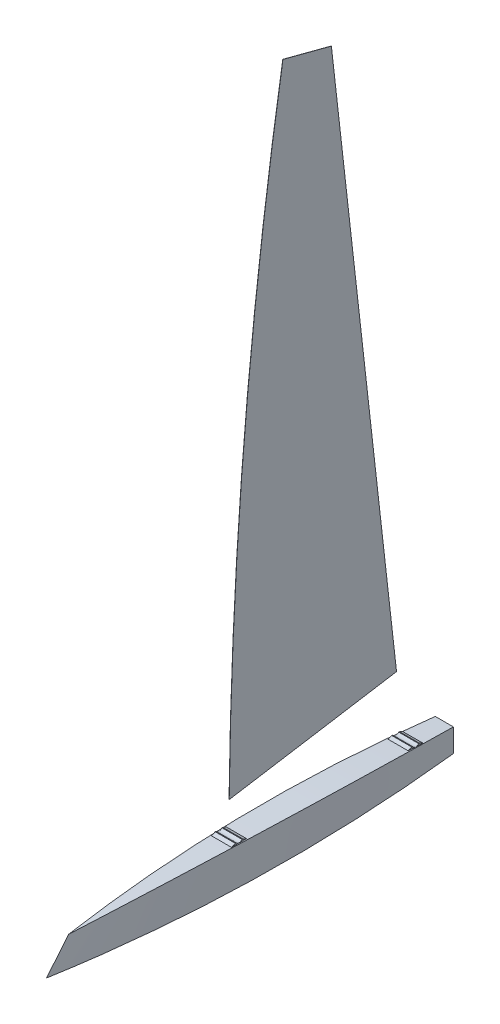
ISO-10303-21;
HEADER;
FILE_DESCRIPTION(('STEP AP214'),'2;1');
FILE_NAME('part.step','',(''),(''),'','','');
FILE_SCHEMA(('AUTOMOTIVE_DESIGN { 1 0 10303 214 1 1 1 1 }'));
ENDSEC;
DATA;
#1=APPLICATION_CONTEXT('core data for automotive mechanical design processes');
#2=APPLICATION_PROTOCOL_DEFINITION('international standard','automotive_design',2000,#1);
#3=PRODUCT_CONTEXT('',#1,'mechanical');
#4=PRODUCT('Part','Part','',(#3));
#5=PRODUCT_RELATED_PRODUCT_CATEGORY('part','',(#4));
#6=PRODUCT_DEFINITION_FORMATION('','',#4);
#7=PRODUCT_DEFINITION_CONTEXT('part definition',#1,'design');
#8=PRODUCT_DEFINITION('design','',#6,#7);
#9=PRODUCT_DEFINITION_SHAPE('','',#8);
#10=(LENGTH_UNIT() NAMED_UNIT(*) SI_UNIT(.MILLI.,.METRE.));
#11=(NAMED_UNIT(*) PLANE_ANGLE_UNIT() SI_UNIT($,.RADIAN.));
#12=(NAMED_UNIT(*) SI_UNIT($,.STERADIAN.) SOLID_ANGLE_UNIT());
#13=UNCERTAINTY_MEASURE_WITH_UNIT(LENGTH_MEASURE(1.E-05),#10,'distance_accuracy_value','');
#14=(GEOMETRIC_REPRESENTATION_CONTEXT(3) GLOBAL_UNCERTAINTY_ASSIGNED_CONTEXT((#13)) GLOBAL_UNIT_ASSIGNED_CONTEXT((#10,
#11,#12)) REPRESENTATION_CONTEXT('',''));
#15=CARTESIAN_POINT('',(0.,0.,0.));
#16=DIRECTION('',(0.,0.,1.));
#17=DIRECTION('',(1.,0.,0.));
#18=AXIS2_PLACEMENT_3D('',#15,#16,#17);
#19=CARTESIAN_POINT('',(2.,165.009193198204,-55771.5122342696));
#20=DIRECTION('',(-1.,0.,0.));
#21=DIRECTION('',(0.,0.,1.));
#22=AXIS2_PLACEMENT_3D('',#19,#20,#21);
#23=CYLINDRICAL_SURFACE('',#22,53408.3333333334);
#24=CARTESIAN_POINT('',(0.,165.009193198204,-55771.5122342696));
#25=DIRECTION('',(1.,0.,0.));
#26=DIRECTION('',(0.,0.,-1.));
#27=AXIS2_PLACEMENT_3D('',#24,#25,#26);
#28=CIRCLE('',#27,53408.3333333334);
#29=CARTESIAN_POINT('',(0.,8791.55758473397,-3064.46590939063));
#30=VERTEX_POINT('',#29);
#31=CARTESIAN_POINT('',(0.,822.,-2367.2199674094));
#32=VERTEX_POINT('',#31);
#33=EDGE_CURVE('E113',#30,#32,#28,.T.);
#34=ORIENTED_EDGE('',*,*,#33,.T.);
#35=DIRECTION('',(-1.,0.,0.));
#36=VECTOR('',#35,1.);
#37=CARTESIAN_POINT('',(2.,822.,-2367.2199674094));
#38=LINE('',#37,#36);
#39=CARTESIAN_POINT('',(2.,822.,-2367.2199674094));
#40=VERTEX_POINT('',#39);
#41=EDGE_CURVE('E12',#40,#32,#38,.T.);
#42=ORIENTED_EDGE('',*,*,#41,.F.);
#43=CARTESIAN_POINT('',(2.,165.009193198204,-55771.5122342696));
#44=DIRECTION('',(1.,0.,0.));
#45=DIRECTION('',(0.,0.,-1.));
#46=AXIS2_PLACEMENT_3D('',#43,#44,#45);
#47=CIRCLE('',#46,53408.3333333334);
#48=CARTESIAN_POINT('',(2.,8791.55758473397,-3064.46590939063));
#49=VERTEX_POINT('',#48);
#50=EDGE_CURVE('E101',#49,#40,#47,.T.);
#51=ORIENTED_EDGE('',*,*,#50,.F.);
#52=DIRECTION('',(-1.,0.,0.));
#53=VECTOR('',#52,1.);
#54=CARTESIAN_POINT('',(2.,8791.55758473397,-3064.46590939063));
#55=LINE('',#54,#53);
#56=EDGE_CURVE('E109',#49,#30,#55,.T.);
#57=ORIENTED_EDGE('',*,*,#56,.T.);
#58=EDGE_LOOP('',(#34,#42,#51,#57));
#59=FACE_BOUND('',#58,.T.);
#60=ADVANCED_FACE('F50',(#59),#23,.T.);
#61=CARTESIAN_POINT('',(2.,822.,-2367.2199674094));
#62=DIRECTION('',(0.,0.987064811696165,0.160321731250675));
#63=DIRECTION('',(0.,-0.160321731250675,0.987064811696166));
#64=AXIS2_PLACEMENT_3D('',#61,#62,#63);
#65=PLANE('',#64);
#66=DIRECTION('',(0.,0.160321731250675,-0.987064811696166));
#67=VECTOR('',#66,1.);
#68=CARTESIAN_POINT('',(0.,822.,-2367.2199674094));
#69=LINE('',#68,#67);
#70=CARTESIAN_POINT('',(0.,1174.70780875148,-4538.76255314097));
#71=VERTEX_POINT('',#70);
#72=EDGE_CURVE('E105',#32,#71,#69,.T.);
#73=ORIENTED_EDGE('',*,*,#72,.T.);
#74=DIRECTION('',(-1.,0.,0.));
#75=VECTOR('',#74,1.);
#76=CARTESIAN_POINT('',(2.,1174.70780875148,-4538.76255314097));
#77=LINE('',#76,#75);
#78=CARTESIAN_POINT('',(2.,1174.70780875148,-4538.76255314097));
#79=VERTEX_POINT('',#78);
#80=EDGE_CURVE('E58',#79,#71,#77,.T.);
#81=ORIENTED_EDGE('',*,*,#80,.F.);
#82=DIRECTION('',(0.,0.160321731250675,-0.987064811696166));
#83=VECTOR('',#82,1.);
#84=CARTESIAN_POINT('',(2.,822.,-2367.2199674094));
#85=LINE('',#84,#83);
#86=EDGE_CURVE('E96',#40,#79,#85,.T.);
#87=ORIENTED_EDGE('',*,*,#86,.F.);
#88=ORIENTED_EDGE('',*,*,#41,.T.);
#89=EDGE_LOOP('',(#73,#81,#87,#88));
#90=FACE_BOUND('',#89,.T.);
#91=ADVANCED_FACE('F104',(#90),#65,.F.);
#92=CARTESIAN_POINT('',(2.,1174.70780875148,-4538.76255314097));
#93=DIRECTION('',(0.,-0.112733136060343,0.993625301627329));
#94=DIRECTION('',(0.,-0.993625301627329,-0.112733136060343));
#95=AXIS2_PLACEMENT_3D('',#92,#93,#94);
#96=PLANE('',#95);
#97=DIRECTION('',(0.,0.993625301627329,0.112733136060343));
#98=VECTOR('',#97,1.);
#99=CARTESIAN_POINT('',(0.,1174.70780875148,-4538.76255314097));
#100=LINE('',#99,#98);
#101=CARTESIAN_POINT('',(0.,8626.89757095645,-3693.26403268839));
#102=VERTEX_POINT('',#101);
#103=EDGE_CURVE('E83',#71,#102,#100,.T.);
#104=ORIENTED_EDGE('',*,*,#103,.T.);
#105=DIRECTION('',(-1.,0.,0.));
#106=VECTOR('',#105,1.);
#107=CARTESIAN_POINT('',(2.,8626.89757095645,-3693.26403268839));
#108=LINE('',#107,#106);
#109=CARTESIAN_POINT('',(2.,8626.89757095645,-3693.26403268839));
#110=VERTEX_POINT('',#109);
#111=EDGE_CURVE('E106',#110,#102,#108,.T.);
#112=ORIENTED_EDGE('',*,*,#111,.F.);
#113=DIRECTION('',(0.,0.993625301627329,0.112733136060343));
#114=VECTOR('',#113,1.);
#115=CARTESIAN_POINT('',(2.,1174.70780875148,-4538.76255314097));
#116=LINE('',#115,#114);
#117=EDGE_CURVE('E99',#79,#110,#116,.T.);
#118=ORIENTED_EDGE('',*,*,#117,.F.);
#119=ORIENTED_EDGE('',*,*,#80,.T.);
#120=EDGE_LOOP('',(#104,#112,#118,#119));
#121=FACE_BOUND('',#120,.T.);
#122=ADVANCED_FACE('F107',(#121),#96,.F.);
#123=CARTESIAN_POINT('',(2.,8626.89757095645,-3693.26403268839));
#124=DIRECTION('',(0.,-0.967381728150404,0.253323098119255));
#125=DIRECTION('',(0.,-0.253323098119255,-0.967381728150404));
#126=AXIS2_PLACEMENT_3D('',#123,#124,#125);
#127=PLANE('',#126);
#128=DIRECTION('',(0.,0.253323098119255,0.967381728150404));
#129=VECTOR('',#128,1.);
#130=CARTESIAN_POINT('',(0.,8626.89757095645,-3693.26403268839));
#131=LINE('',#130,#129);
#132=EDGE_CURVE('E89',#102,#30,#131,.T.);
#133=ORIENTED_EDGE('',*,*,#132,.T.);
#134=ORIENTED_EDGE('',*,*,#56,.F.);
#135=DIRECTION('',(0.,0.253323098119255,0.967381728150404));
#136=VECTOR('',#135,1.);
#137=CARTESIAN_POINT('',(2.,8626.89757095645,-3693.26403268839));
#138=LINE('',#137,#136);
#139=EDGE_CURVE('E66',#110,#49,#138,.T.);
#140=ORIENTED_EDGE('',*,*,#139,.F.);
#141=ORIENTED_EDGE('',*,*,#111,.T.);
#142=EDGE_LOOP('',(#133,#134,#140,#141));
#143=FACE_BOUND('',#142,.T.);
#144=ADVANCED_FACE('F120',(#143),#127,.F.);
#145=CARTESIAN_POINT('',(2.,165.009193198204,-55771.5122342696));
#146=DIRECTION('',(1.,0.,0.));
#147=DIRECTION('',(0.,0.,-1.));
#148=AXIS2_PLACEMENT_3D('',#145,#146,#147);
#149=PLANE('',#148);
#150=ORIENTED_EDGE('',*,*,#50,.T.);
#151=ORIENTED_EDGE('',*,*,#86,.T.);
#152=ORIENTED_EDGE('',*,*,#117,.T.);
#153=ORIENTED_EDGE('',*,*,#139,.T.);
#154=EDGE_LOOP('',(#150,#151,#152,#153));
#155=FACE_BOUND('',#154,.T.);
#156=ADVANCED_FACE('F97',(#155),#149,.T.);
#157=CARTESIAN_POINT('',(0.,165.009193198204,-55771.5122342696));
#158=DIRECTION('',(1.,0.,0.));
#159=DIRECTION('',(0.,0.,-1.));
#160=AXIS2_PLACEMENT_3D('',#157,#158,#159);
#161=PLANE('',#160);
#162=ORIENTED_EDGE('',*,*,#33,.F.);
#163=ORIENTED_EDGE('',*,*,#132,.F.);
#164=ORIENTED_EDGE('',*,*,#103,.F.);
#165=ORIENTED_EDGE('',*,*,#72,.F.);
#166=EDGE_LOOP('',(#162,#163,#164,#165));
#167=FACE_BOUND('',#166,.T.);
#168=ADVANCED_FACE('F123',(#167),#161,.F.);
#169=CLOSED_SHELL('',(#60,#91,#122,#144,#156,#168));
#170=MANIFOLD_SOLID_BREP('B2',#169);
#171=CARTESIAN_POINT('',(130.,452.000000000002,-2367.2199674094));
#172=DIRECTION('',(-1.,0.,0.));
#173=DIRECTION('',(0.,0.,1.));
#174=AXIS2_PLACEMENT_3D('',#171,#172,#173);
#175=CYLINDRICAL_SURFACE('',#174,50.9999999999999);
#176=CARTESIAN_POINT('',(-130.,452.000000000002,-2367.2199674094));
#177=DIRECTION('',(-1.,0.,0.));
#178=DIRECTION('',(0.,0.,-1.));
#179=AXIS2_PLACEMENT_3D('',#176,#177,#178);
#180=CIRCLE('',#179,50.9999999999999);
#181=CARTESIAN_POINT('',(-130.,419.413616232792,-2406.45168408069));
#182=VERTEX_POINT('',#181);
#183=CARTESIAN_POINT('',(-130.,419.505404729545,-2327.9121911023));
#184=VERTEX_POINT('',#183);
#185=EDGE_CURVE('E279',#182,#184,#180,.T.);
#186=ORIENTED_EDGE('',*,*,#185,.T.);
#187=DIRECTION('',(-1.,0.,0.));
#188=VECTOR('',#187,1.);
#189=CARTESIAN_POINT('',(130.,419.505404729545,-2327.9121911023));
#190=LINE('',#189,#188);
#191=CARTESIAN_POINT('',(130.,419.505404729545,-2327.9121911023));
#192=VERTEX_POINT('',#191);
#193=EDGE_CURVE('E48',#192,#184,#190,.T.);
#194=ORIENTED_EDGE('',*,*,#193,.F.);
#195=CARTESIAN_POINT('',(130.,452.000000000002,-2367.2199674094));
#196=DIRECTION('',(-1.,0.,0.));
#197=DIRECTION('',(0.,0.,-1.));
#198=AXIS2_PLACEMENT_3D('',#195,#196,#197);
#199=CIRCLE('',#198,50.9999999999999);
#200=CARTESIAN_POINT('',(130.,419.413616232792,-2406.45168408069));
#201=VERTEX_POINT('',#200);
#202=EDGE_CURVE('E293',#201,#192,#199,.T.);
#203=ORIENTED_EDGE('',*,*,#202,.F.);
#204=DIRECTION('',(-1.,0.,0.));
#205=VECTOR('',#204,1.);
#206=CARTESIAN_POINT('',(130.,419.413616232792,-2406.45168408069));
#207=LINE('',#206,#205);
#208=EDGE_CURVE('E275',#201,#182,#207,.T.);
#209=ORIENTED_EDGE('',*,*,#208,.T.);
#210=EDGE_LOOP('',(#186,#194,#203,#209));
#211=FACE_BOUND('',#210,.T.);
#212=ADVANCED_FACE('F183',(#211),#175,.F.);
#213=CARTESIAN_POINT('',(130.,419.505404729545,-2327.9121911023));
#214=DIRECTION('',(0.,-0.999999317079912,0.00116869145196931));
#215=DIRECTION('',(0.,-0.00116869145196931,-0.999999317079912));
#216=AXIS2_PLACEMENT_3D('',#213,#214,#215);
#217=PLANE('',#216);
#218=DIRECTION('',(0.,0.00116869145196931,0.999999317079912));
#219=VECTOR('',#218,1.);
#220=CARTESIAN_POINT('',(-130.,419.505404729545,-2327.9121911023));
#221=LINE('',#220,#219);
#222=CARTESIAN_POINT('',(-130.,419.517091644065,-2317.9121979315));
#223=VERTEX_POINT('',#222);
#224=EDGE_CURVE('E282',#184,#223,#221,.T.);
#225=ORIENTED_EDGE('',*,*,#224,.T.);
#226=DIRECTION('',(-1.,0.,0.));
#227=VECTOR('',#226,1.);
#228=CARTESIAN_POINT('',(130.,419.517091644065,-2317.9121979315));
#229=LINE('',#228,#227);
#230=CARTESIAN_POINT('',(130.,419.517091644065,-2317.9121979315));
#231=VERTEX_POINT('',#230);
#232=EDGE_CURVE('E191',#231,#223,#229,.T.);
#233=ORIENTED_EDGE('',*,*,#232,.F.);
#234=DIRECTION('',(0.,0.00116869145196931,0.999999317079912));
#235=VECTOR('',#234,1.);
#236=CARTESIAN_POINT('',(130.,419.505404729545,-2327.9121911023));
#237=LINE('',#236,#235);
#238=EDGE_CURVE('E242',#192,#231,#237,.T.);
#239=ORIENTED_EDGE('',*,*,#238,.F.);
#240=ORIENTED_EDGE('',*,*,#193,.T.);
#241=EDGE_LOOP('',(#225,#233,#239,#240));
#242=FACE_BOUND('',#241,.T.);
#243=ADVANCED_FACE('F328',(#242),#217,.F.);
#244=CARTESIAN_POINT('',(130.,419.517091644065,-2317.9121979315));
#245=DIRECTION('',(0.,-0.925955656220427,-0.377632258570953));
#246=DIRECTION('',(0.,0.377632258570953,-0.925955656220427));
#247=AXIS2_PLACEMENT_3D('',#244,#245,#246);
#248=PLANE('',#247);
#249=DIRECTION('',(0.,-0.377632258570953,0.925955656220427));
#250=VECTOR('',#249,1.);
#251=CARTESIAN_POINT('',(-130.,419.517091644065,-2317.9121979315));
#252=LINE('',#251,#250);
#253=CARTESIAN_POINT('',(-130.,398.507173378865,-2266.39580278028));
#254=VERTEX_POINT('',#253);
#255=EDGE_CURVE('E284',#223,#254,#252,.T.);
#256=ORIENTED_EDGE('',*,*,#255,.T.);
#257=DIRECTION('',(-1.,0.,0.));
#258=VECTOR('',#257,1.);
#259=CARTESIAN_POINT('',(130.,398.507173378865,-2266.39580278028));
#260=LINE('',#259,#258);
#261=CARTESIAN_POINT('',(130.,398.507173378865,-2266.39580278028));
#262=VERTEX_POINT('',#261);
#263=EDGE_CURVE('E300',#262,#254,#260,.T.);
#264=ORIENTED_EDGE('',*,*,#263,.F.);
#265=DIRECTION('',(0.,-0.377632258570953,0.925955656220427));
#266=VECTOR('',#265,1.);
#267=CARTESIAN_POINT('',(130.,419.517091644065,-2317.9121979315));
#268=LINE('',#267,#266);
#269=EDGE_CURVE('E308',#231,#262,#268,.T.);
#270=ORIENTED_EDGE('',*,*,#269,.F.);
#271=ORIENTED_EDGE('',*,*,#232,.T.);
#272=EDGE_LOOP('',(#256,#264,#270,#271));
#273=FACE_BOUND('',#272,.T.);
#274=ADVANCED_FACE('F306',(#273),#248,.F.);
#275=CARTESIAN_POINT('',(130.,398.507173378865,-2266.39580278028));
#276=DIRECTION('',(0.,-0.00116869145155625,-0.999999317079912));
#277=DIRECTION('',(0.,0.999999317079913,-0.00116869145155625));
#278=AXIS2_PLACEMENT_3D('',#275,#276,#277);
#279=PLANE('',#278);
#280=DIRECTION('',(0.,-0.999999317079912,0.00116869145155625));
#281=VECTOR('',#280,1.);
#282=CARTESIAN_POINT('',(-130.,398.507173378865,-2266.39580278028));
#283=LINE('',#282,#281);
#284=CARTESIAN_POINT('',(-130.,393.515237661271,-2266.38996874369));
#285=VERTEX_POINT('',#284);
#286=EDGE_CURVE('E286',#254,#285,#283,.T.);
#287=ORIENTED_EDGE('',*,*,#286,.T.);
#288=DIRECTION('',(-1.,0.,0.));
#289=VECTOR('',#288,1.);
#290=CARTESIAN_POINT('',(130.,393.515237661271,-2266.38996874369));
#291=LINE('',#290,#289);
#292=CARTESIAN_POINT('',(130.,393.515237661271,-2266.38996874369));
#293=VERTEX_POINT('',#292);
#294=EDGE_CURVE('E297',#293,#285,#291,.T.);
#295=ORIENTED_EDGE('',*,*,#294,.F.);
#296=DIRECTION('',(0.,-0.999999317079912,0.00116869145155625));
#297=VECTOR('',#296,1.);
#298=CARTESIAN_POINT('',(130.,398.507173378865,-2266.39580278028));
#299=LINE('',#298,#297);
#300=EDGE_CURVE('E320',#262,#293,#299,.T.);
#301=ORIENTED_EDGE('',*,*,#300,.F.);
#302=ORIENTED_EDGE('',*,*,#263,.T.);
#303=EDGE_LOOP('',(#287,#295,#301,#302));
#304=FACE_BOUND('',#303,.T.);
#305=ADVANCED_FACE('F316',(#304),#279,.F.);
#306=CARTESIAN_POINT('',(130.,393.515237661271,-2266.38996874369));
#307=DIRECTION('',(0.,0.999999317079912,-0.00116869145197068));
#308=DIRECTION('',(0.,0.00116869145197068,0.999999317079912));
#309=AXIS2_PLACEMENT_3D('',#306,#307,#308);
#310=PLANE('',#309);
#311=DIRECTION('',(0.,-0.00116869145197068,-0.999999317079912));
#312=VECTOR('',#311,1.);
#313=CARTESIAN_POINT('',(-130.,393.515237661271,-2266.38996874369));
#314=LINE('',#313,#312);
#315=CARTESIAN_POINT('',(-130.,393.281499370877,-2466.38983215968));
#316=VERTEX_POINT('',#315);
#317=EDGE_CURVE('E288',#285,#316,#314,.T.);
#318=ORIENTED_EDGE('',*,*,#317,.T.);
#319=DIRECTION('',(-1.,0.,0.));
#320=VECTOR('',#319,1.);
#321=CARTESIAN_POINT('',(130.,393.281499370877,-2466.38983215968));
#322=LINE('',#321,#320);
#323=CARTESIAN_POINT('',(130.,393.281499370877,-2466.38983215968));
#324=VERTEX_POINT('',#323);
#325=EDGE_CURVE('E270',#324,#316,#322,.T.);
#326=ORIENTED_EDGE('',*,*,#325,.F.);
#327=DIRECTION('',(0.,-0.00116869145197068,-0.999999317079912));
#328=VECTOR('',#327,1.);
#329=CARTESIAN_POINT('',(130.,393.515237661271,-2266.38996874369));
#330=LINE('',#329,#328);
#331=EDGE_CURVE('E261',#293,#324,#330,.T.);
#332=ORIENTED_EDGE('',*,*,#331,.F.);
#333=ORIENTED_EDGE('',*,*,#294,.T.);
#334=EDGE_LOOP('',(#318,#326,#332,#333));
#335=FACE_BOUND('',#334,.T.);
#336=ADVANCED_FACE('F319',(#335),#310,.F.);
#337=CARTESIAN_POINT('',(130.,398.273435088473,-2466.39566619626));
#338=DIRECTION('',(0.,0.00116869145200072,0.999999317079912));
#339=DIRECTION('',(0.,-0.999999317079912,0.00116869145200072));
#340=AXIS2_PLACEMENT_3D('',#337,#338,#339);
#341=PLANE('',#340);
#342=DIRECTION('',(0.,0.999999317079912,-0.00116869145200072));
#343=VECTOR('',#342,1.);
#344=CARTESIAN_POINT('',(-130.,398.273435088473,-2466.39566619626));
#345=LINE('',#344,#343);
#346=CARTESIAN_POINT('',(-130.,398.273435088473,-2466.39566619626));
#347=VERTEX_POINT('',#346);
#348=EDGE_CURVE('E269',#316,#347,#345,.T.);
#349=ORIENTED_EDGE('',*,*,#348,.T.);
#350=DIRECTION('',(-1.,0.,0.));
#351=VECTOR('',#350,1.);
#352=CARTESIAN_POINT('',(130.,398.273435088473,-2466.39566619626));
#353=LINE('',#352,#351);
#354=CARTESIAN_POINT('',(130.,398.273435088473,-2466.39566619626));
#355=VERTEX_POINT('',#354);
#356=EDGE_CURVE('E266',#355,#347,#353,.T.);
#357=ORIENTED_EDGE('',*,*,#356,.F.);
#358=DIRECTION('',(0.,0.999999317079912,-0.00116869145200072));
#359=VECTOR('',#358,1.);
#360=CARTESIAN_POINT('',(130.,398.273435088473,-2466.39566619626));
#361=LINE('',#360,#359);
#362=EDGE_CURVE('E255',#324,#355,#361,.T.);
#363=ORIENTED_EDGE('',*,*,#362,.F.);
#364=ORIENTED_EDGE('',*,*,#325,.T.);
#365=EDGE_LOOP('',(#349,#357,#363,#364));
#366=FACE_BOUND('',#365,.T.);
#367=ADVANCED_FACE('F267',(#366),#341,.F.);
#368=CARTESIAN_POINT('',(130.,419.401909645947,-2416.46851001997));
#369=DIRECTION('',(0.,-0.920931193328839,0.389725207234432));
#370=DIRECTION('',(0.,-0.389725207234432,-0.920931193328839));
#371=AXIS2_PLACEMENT_3D('',#368,#369,#370);
#372=PLANE('',#371);
#373=DIRECTION('',(0.,0.389725207234432,0.920931193328839));
#374=VECTOR('',#373,1.);
#375=CARTESIAN_POINT('',(-130.,419.401909645947,-2416.46851001997));
#376=LINE('',#375,#374);
#377=CARTESIAN_POINT('',(-130.,419.401909645947,-2416.46851001997));
#378=VERTEX_POINT('',#377);
#379=EDGE_CURVE('E228',#347,#378,#376,.T.);
#380=ORIENTED_EDGE('',*,*,#379,.T.);
#381=DIRECTION('',(-1.,0.,0.));
#382=VECTOR('',#381,1.);
#383=CARTESIAN_POINT('',(130.,419.401909645947,-2416.46851001997));
#384=LINE('',#383,#382);
#385=CARTESIAN_POINT('',(130.,419.401909645947,-2416.46851001997));
#386=VERTEX_POINT('',#385);
#387=EDGE_CURVE('E271',#386,#378,#384,.T.);
#388=ORIENTED_EDGE('',*,*,#387,.F.);
#389=DIRECTION('',(0.,0.389725207234432,0.920931193328839));
#390=VECTOR('',#389,1.);
#391=CARTESIAN_POINT('',(130.,419.401909645947,-2416.46851001997));
#392=LINE('',#391,#390);
#393=EDGE_CURVE('E259',#355,#386,#392,.T.);
#394=ORIENTED_EDGE('',*,*,#393,.F.);
#395=ORIENTED_EDGE('',*,*,#356,.T.);
#396=EDGE_LOOP('',(#380,#388,#394,#395));
#397=FACE_BOUND('',#396,.T.);
#398=ADVANCED_FACE('F273',(#397),#372,.F.);
#399=CARTESIAN_POINT('',(130.,419.413616232792,-2406.45168408069));
#400=DIRECTION('',(0.,-0.999999317079912,0.00116869145197264));
#401=DIRECTION('',(0.,-0.00116869145197264,-0.999999317079912));
#402=AXIS2_PLACEMENT_3D('',#399,#400,#401);
#403=PLANE('',#402);
#404=DIRECTION('',(0.,0.00116869145197264,0.999999317079912));
#405=VECTOR('',#404,1.);
#406=CARTESIAN_POINT('',(-130.,419.413616232792,-2406.45168408069));
#407=LINE('',#406,#405);
#408=EDGE_CURVE('E234',#378,#182,#407,.T.);
#409=ORIENTED_EDGE('',*,*,#408,.T.);
#410=ORIENTED_EDGE('',*,*,#208,.F.);
#411=DIRECTION('',(0.,0.00116869145197264,0.999999317079912));
#412=VECTOR('',#411,1.);
#413=CARTESIAN_POINT('',(130.,419.413616232792,-2406.45168408069));
#414=LINE('',#413,#412);
#415=EDGE_CURVE('E199',#386,#201,#414,.T.);
#416=ORIENTED_EDGE('',*,*,#415,.F.);
#417=ORIENTED_EDGE('',*,*,#387,.T.);
#418=EDGE_LOOP('',(#409,#410,#416,#417));
#419=FACE_BOUND('',#418,.T.);
#420=ADVANCED_FACE('F344',(#419),#403,.F.);
#421=CARTESIAN_POINT('',(130.,452.000000000002,-2367.2199674094));
#422=DIRECTION('',(1.,0.,0.));
#423=DIRECTION('',(0.,0.,-1.));
#424=AXIS2_PLACEMENT_3D('',#421,#422,#423);
#425=PLANE('',#424);
#426=ORIENTED_EDGE('',*,*,#202,.T.);
#427=ORIENTED_EDGE('',*,*,#238,.T.);
#428=ORIENTED_EDGE('',*,*,#269,.T.);
#429=ORIENTED_EDGE('',*,*,#300,.T.);
#430=ORIENTED_EDGE('',*,*,#331,.T.);
#431=ORIENTED_EDGE('',*,*,#362,.T.);
#432=ORIENTED_EDGE('',*,*,#393,.T.);
#433=ORIENTED_EDGE('',*,*,#415,.T.);
#434=EDGE_LOOP('',(#426,#427,#428,#429,#430,#431,#432,#433));
#435=FACE_BOUND('',#434,.T.);
#436=ADVANCED_FACE('F257',(#435),#425,.T.);
#437=CARTESIAN_POINT('',(-130.,452.000000000002,-2367.2199674094));
#438=DIRECTION('',(1.,0.,0.));
#439=DIRECTION('',(0.,0.,-1.));
#440=AXIS2_PLACEMENT_3D('',#437,#438,#439);
#441=PLANE('',#440);
#442=ORIENTED_EDGE('',*,*,#185,.F.);
#443=ORIENTED_EDGE('',*,*,#408,.F.);
#444=ORIENTED_EDGE('',*,*,#379,.F.);
#445=ORIENTED_EDGE('',*,*,#348,.F.);
#446=ORIENTED_EDGE('',*,*,#317,.F.);
#447=ORIENTED_EDGE('',*,*,#286,.F.);
#448=ORIENTED_EDGE('',*,*,#255,.F.);
#449=ORIENTED_EDGE('',*,*,#224,.F.);
#450=EDGE_LOOP('',(#442,#443,#444,#445,#446,#447,#448,#449));
#451=FACE_BOUND('',#450,.T.);
#452=ADVANCED_FACE('F312',(#451),#441,.F.);
#453=CLOSED_SHELL('',(#212,#243,#274,#305,#336,#367,#398,#420,#436,#452));
#454=MANIFOLD_SOLID_BREP('B6',#453);
#455=CARTESIAN_POINT('',(130.,384.135187442793,-4661.2163421268));
#456=DIRECTION('',(-1.,0.,0.));
#457=DIRECTION('',(0.,0.,1.));
#458=AXIS2_PLACEMENT_3D('',#455,#456,#457);
#459=CYLINDRICAL_SURFACE('',#458,51.);
#460=CARTESIAN_POINT('',(-130.,384.135187442793,-4661.2163421268));
#461=DIRECTION('',(-1.,0.,0.));
#462=DIRECTION('',(0.,0.,-1.));
#463=AXIS2_PLACEMENT_3D('',#460,#461,#462);
#464=CIRCLE('',#463,51.);
#465=CARTESIAN_POINT('',(-130.,349.373718303237,-4698.53443778105));
#466=VERTEX_POINT('',#465);
#467=CARTESIAN_POINT('',(-130.,353.924998461992,-4620.12687289508));
#468=VERTEX_POINT('',#467);
#469=EDGE_CURVE('E515',#466,#468,#464,.T.);
#470=ORIENTED_EDGE('',*,*,#469,.T.);
#471=DIRECTION('',(-1.,0.,0.));
#472=VECTOR('',#471,1.);
#473=CARTESIAN_POINT('',(130.,353.924998461992,-4620.12687289508));
#474=LINE('',#473,#472);
#475=CARTESIAN_POINT('',(130.,353.924998461992,-4620.12687289508));
#476=VERTEX_POINT('',#475);
#477=EDGE_CURVE('E181',#476,#468,#474,.T.);
#478=ORIENTED_EDGE('',*,*,#477,.F.);
#479=CARTESIAN_POINT('',(130.,384.135187442793,-4661.2163421268));
#480=DIRECTION('',(-1.,0.,0.));
#481=DIRECTION('',(0.,0.,-1.));
#482=AXIS2_PLACEMENT_3D('',#479,#480,#481);
#483=CIRCLE('',#482,51.);
#484=CARTESIAN_POINT('',(130.,349.373718303237,-4698.53443778105));
#485=VERTEX_POINT('',#484);
#486=EDGE_CURVE('E529',#485,#476,#483,.T.);
#487=ORIENTED_EDGE('',*,*,#486,.F.);
#488=DIRECTION('',(-1.,0.,0.));
#489=VECTOR('',#488,1.);
#490=CARTESIAN_POINT('',(130.,349.373718303237,-4698.53443778105));
#491=LINE('',#490,#489);
#492=EDGE_CURVE('E511',#485,#466,#491,.T.);
#493=ORIENTED_EDGE('',*,*,#492,.T.);
#494=EDGE_LOOP('',(#470,#478,#487,#493));
#495=FACE_BOUND('',#494,.T.);
#496=ADVANCED_FACE('F419',(#495),#459,.F.);
#497=CARTESIAN_POINT('',(130.,353.924998461992,-4620.12687289508));
#498=DIRECTION('',(0.,-0.998319550667832,0.0579488977839872));
#499=DIRECTION('',(0.,-0.0579488977839872,-0.998319550667832));
#500=AXIS2_PLACEMENT_3D('',#497,#498,#499);
#501=PLANE('',#500);
#502=DIRECTION('',(0.,0.0579488977839872,0.998319550667831));
#503=VECTOR('',#502,1.);
#504=CARTESIAN_POINT('',(-130.,353.924998461992,-4620.12687289508));
#505=LINE('',#504,#503);
#506=CARTESIAN_POINT('',(-130.,354.504487439832,-4610.1436773884));
#507=VERTEX_POINT('',#506);
#508=EDGE_CURVE('E518',#468,#507,#505,.T.);
#509=ORIENTED_EDGE('',*,*,#508,.T.);
#510=DIRECTION('',(-1.,0.,0.));
#511=VECTOR('',#510,1.);
#512=CARTESIAN_POINT('',(130.,354.504487439832,-4610.1436773884));
#513=LINE('',#512,#511);
#514=CARTESIAN_POINT('',(130.,354.504487439832,-4610.1436773884));
#515=VERTEX_POINT('',#514);
#516=EDGE_CURVE('E427',#515,#507,#513,.T.);
#517=ORIENTED_EDGE('',*,*,#516,.F.);
#518=DIRECTION('',(0.,0.0579488977839872,0.998319550667831));
#519=VECTOR('',#518,1.);
#520=CARTESIAN_POINT('',(130.,353.924998461992,-4620.12687289508));
#521=LINE('',#520,#519);
#522=EDGE_CURVE('E478',#476,#515,#521,.T.);
#523=ORIENTED_EDGE('',*,*,#522,.F.);
#524=ORIENTED_EDGE('',*,*,#477,.T.);
#525=EDGE_LOOP('',(#509,#517,#523,#524));
#526=FACE_BOUND('',#525,.T.);
#527=ADVANCED_FACE('F564',(#526),#501,.F.);
#528=CARTESIAN_POINT('',(130.,354.504487439832,-4610.1436773884));
#529=DIRECTION('',(0.,-0.945904477396131,-0.324445249066698));
#530=DIRECTION('',(0.,0.324445249066698,-0.945904477396131));
#531=AXIS2_PLACEMENT_3D('',#528,#529,#530);
#532=PLANE('',#531);
#533=DIRECTION('',(0.,-0.324445249066698,0.945904477396131));
#534=VECTOR('',#533,1.);
#535=CARTESIAN_POINT('',(-130.,354.504487439832,-4610.1436773884));
#536=LINE('',#535,#534);
#537=CARTESIAN_POINT('',(-130.,336.453677399876,-4557.51741121087));
#538=VERTEX_POINT('',#537);
#539=EDGE_CURVE('E520',#507,#538,#536,.T.);
#540=ORIENTED_EDGE('',*,*,#539,.T.);
#541=DIRECTION('',(-1.,0.,0.));
#542=VECTOR('',#541,1.);
#543=CARTESIAN_POINT('',(130.,336.453677399876,-4557.51741121087));
#544=LINE('',#543,#542);
#545=CARTESIAN_POINT('',(130.,336.453677399876,-4557.51741121087));
#546=VERTEX_POINT('',#545);
#547=EDGE_CURVE('E536',#546,#538,#544,.T.);
#548=ORIENTED_EDGE('',*,*,#547,.F.);
#549=DIRECTION('',(0.,-0.324445249066698,0.945904477396131));
#550=VECTOR('',#549,1.);
#551=CARTESIAN_POINT('',(130.,354.504487439832,-4610.1436773884));
#552=LINE('',#551,#550);
#553=EDGE_CURVE('E544',#515,#546,#552,.T.);
#554=ORIENTED_EDGE('',*,*,#553,.F.);
#555=ORIENTED_EDGE('',*,*,#516,.T.);
#556=EDGE_LOOP('',(#540,#548,#554,#555));
#557=FACE_BOUND('',#556,.T.);
#558=ADVANCED_FACE('F542',(#557),#532,.F.);
#559=CARTESIAN_POINT('',(130.,336.453677399876,-4557.51741121087));
#560=DIRECTION('',(0.,-0.0579488977836595,-0.99831955066785));
#561=DIRECTION('',(0.,0.998319550667851,-0.0579488977836595));
#562=AXIS2_PLACEMENT_3D('',#559,#560,#561);
#563=PLANE('',#562);
#564=DIRECTION('',(0.,-0.99831955066785,0.0579488977836595));
#565=VECTOR('',#564,1.);
#566=CARTESIAN_POINT('',(-130.,336.453677399876,-4557.51741121087));
#567=LINE('',#566,#565);
#568=CARTESIAN_POINT('',(-130.,331.470126973958,-4557.22813384067));
#569=VERTEX_POINT('',#568);
#570=EDGE_CURVE('E522',#538,#569,#567,.T.);
#571=ORIENTED_EDGE('',*,*,#570,.T.);
#572=DIRECTION('',(-1.,0.,0.));
#573=VECTOR('',#572,1.);
#574=CARTESIAN_POINT('',(130.,331.470126973958,-4557.22813384067));
#575=LINE('',#574,#573);
#576=CARTESIAN_POINT('',(130.,331.470126973958,-4557.22813384067));
#577=VERTEX_POINT('',#576);
#578=EDGE_CURVE('E533',#577,#569,#575,.T.);
#579=ORIENTED_EDGE('',*,*,#578,.F.);
#580=DIRECTION('',(0.,-0.99831955066785,0.0579488977836595));
#581=VECTOR('',#580,1.);
#582=CARTESIAN_POINT('',(130.,336.453677399876,-4557.51741121087));
#583=LINE('',#582,#581);
#584=EDGE_CURVE('E556',#546,#577,#583,.T.);
#585=ORIENTED_EDGE('',*,*,#584,.F.);
#586=ORIENTED_EDGE('',*,*,#547,.T.);
#587=EDGE_LOOP('',(#571,#579,#585,#586));
#588=FACE_BOUND('',#587,.T.);
#589=ADVANCED_FACE('F552',(#588),#563,.F.);
#590=CARTESIAN_POINT('',(130.,331.470126973958,-4557.22813384067));
#591=DIRECTION('',(0.,0.998319550667831,-0.0579488977839888));
#592=DIRECTION('',(0.,0.0579488977839888,0.998319550667832));
#593=AXIS2_PLACEMENT_3D('',#590,#591,#592);
#594=PLANE('',#593);
#595=DIRECTION('',(0.,-0.0579488977839888,-0.998319550667831));
#596=VECTOR('',#595,1.);
#597=CARTESIAN_POINT('',(-130.,331.470126973958,-4557.22813384067));
#598=LINE('',#597,#596);
#599=CARTESIAN_POINT('',(-130.,319.88034741716,-4756.89204397424));
#600=VERTEX_POINT('',#599);
#601=EDGE_CURVE('E524',#569,#600,#598,.T.);
#602=ORIENTED_EDGE('',*,*,#601,.T.);
#603=DIRECTION('',(-1.,0.,0.));
#604=VECTOR('',#603,1.);
#605=CARTESIAN_POINT('',(130.,319.88034741716,-4756.89204397424));
#606=LINE('',#605,#604);
#607=CARTESIAN_POINT('',(130.,319.88034741716,-4756.89204397424));
#608=VERTEX_POINT('',#607);
#609=EDGE_CURVE('E506',#608,#600,#606,.T.);
#610=ORIENTED_EDGE('',*,*,#609,.F.);
#611=DIRECTION('',(0.,-0.0579488977839888,-0.998319550667831));
#612=VECTOR('',#611,1.);
#613=CARTESIAN_POINT('',(130.,331.470126973958,-4557.22813384067));
#614=LINE('',#613,#612);
#615=EDGE_CURVE('E497',#577,#608,#614,.T.);
#616=ORIENTED_EDGE('',*,*,#615,.F.);
#617=ORIENTED_EDGE('',*,*,#578,.T.);
#618=EDGE_LOOP('',(#602,#610,#616,#617));
#619=FACE_BOUND('',#618,.T.);
#620=ADVANCED_FACE('F555',(#619),#594,.F.);
#621=CARTESIAN_POINT('',(130.,324.86389784308,-4757.18132134443));
#622=DIRECTION('',(0.,0.0579488977839994,0.998319550667831));
#623=DIRECTION('',(0.,-0.998319550667831,0.0579488977839994));
#624=AXIS2_PLACEMENT_3D('',#621,#622,#623);
#625=PLANE('',#624);
#626=DIRECTION('',(0.,0.998319550667831,-0.0579488977839994));
#627=VECTOR('',#626,1.);
#628=CARTESIAN_POINT('',(-130.,324.86389784308,-4757.18132134443));
#629=LINE('',#628,#627);
#630=CARTESIAN_POINT('',(-130.,324.86389784308,-4757.18132134443));
#631=VERTEX_POINT('',#630);
#632=EDGE_CURVE('E505',#600,#631,#629,.T.);
#633=ORIENTED_EDGE('',*,*,#632,.T.);
#634=DIRECTION('',(-1.,0.,0.));
#635=VECTOR('',#634,1.);
#636=CARTESIAN_POINT('',(130.,324.86389784308,-4757.18132134443));
#637=LINE('',#636,#635);
#638=CARTESIAN_POINT('',(130.,324.86389784308,-4757.18132134443));
#639=VERTEX_POINT('',#638);
#640=EDGE_CURVE('E502',#639,#631,#637,.T.);
#641=ORIENTED_EDGE('',*,*,#640,.F.);
#642=DIRECTION('',(0.,0.998319550667831,-0.0579488977839994));
#643=VECTOR('',#642,1.);
#644=CARTESIAN_POINT('',(130.,324.86389784308,-4757.18132134443));
#645=LINE('',#644,#643);
#646=EDGE_CURVE('E491',#608,#639,#645,.T.);
#647=ORIENTED_EDGE('',*,*,#646,.F.);
#648=ORIENTED_EDGE('',*,*,#609,.T.);
#649=EDGE_LOOP('',(#633,#641,#647,#648));
#650=FACE_BOUND('',#649,.T.);
#651=ADVANCED_FACE('F503',(#650),#625,.F.);
#652=CARTESIAN_POINT('',(130.,348.793253884351,-4708.53443778107));
#653=DIRECTION('',(0.,-0.897315929101801,0.441388857335764));
#654=DIRECTION('',(0.,-0.441388857335764,-0.897315929101801));
#655=AXIS2_PLACEMENT_3D('',#652,#653,#654);
#656=PLANE('',#655);
#657=DIRECTION('',(0.,0.441388857335764,0.897315929101801));
#658=VECTOR('',#657,1.);
#659=CARTESIAN_POINT('',(-130.,348.793253884351,-4708.53443778107));
#660=LINE('',#659,#658);
#661=CARTESIAN_POINT('',(-130.,348.793253884351,-4708.53443778107));
#662=VERTEX_POINT('',#661);
#663=EDGE_CURVE('E464',#631,#662,#660,.T.);
#664=ORIENTED_EDGE('',*,*,#663,.T.);
#665=DIRECTION('',(-1.,0.,0.));
#666=VECTOR('',#665,1.);
#667=CARTESIAN_POINT('',(130.,348.793253884351,-4708.53443778107));
#668=LINE('',#667,#666);
#669=CARTESIAN_POINT('',(130.,348.793253884351,-4708.53443778107));
#670=VERTEX_POINT('',#669);
#671=EDGE_CURVE('E507',#670,#662,#668,.T.);
#672=ORIENTED_EDGE('',*,*,#671,.F.);
#673=DIRECTION('',(0.,0.441388857335764,0.897315929101801));
#674=VECTOR('',#673,1.);
#675=CARTESIAN_POINT('',(130.,348.793253884351,-4708.53443778107));
#676=LINE('',#675,#674);
#677=EDGE_CURVE('E495',#639,#670,#676,.T.);
#678=ORIENTED_EDGE('',*,*,#677,.F.);
#679=ORIENTED_EDGE('',*,*,#640,.T.);
#680=EDGE_LOOP('',(#664,#672,#678,#679));
#681=FACE_BOUND('',#680,.T.);
#682=ADVANCED_FACE('F509',(#681),#656,.F.);
#683=CARTESIAN_POINT('',(130.,349.373718303237,-4698.53443778105));
#684=DIRECTION('',(0.,-0.998319550667831,0.0579488977839903));
#685=DIRECTION('',(0.,-0.0579488977839903,-0.998319550667832));
#686=AXIS2_PLACEMENT_3D('',#683,#684,#685);
#687=PLANE('',#686);
#688=DIRECTION('',(0.,0.0579488977839903,0.998319550667831));
#689=VECTOR('',#688,1.);
#690=CARTESIAN_POINT('',(-130.,349.373718303237,-4698.53443778105));
#691=LINE('',#690,#689);
#692=EDGE_CURVE('E470',#662,#466,#691,.T.);
#693=ORIENTED_EDGE('',*,*,#692,.T.);
#694=ORIENTED_EDGE('',*,*,#492,.F.);
#695=DIRECTION('',(0.,0.0579488977839903,0.998319550667831));
#696=VECTOR('',#695,1.);
#697=CARTESIAN_POINT('',(130.,349.373718303237,-4698.53443778105));
#698=LINE('',#697,#696);
#699=EDGE_CURVE('E435',#670,#485,#698,.T.);
#700=ORIENTED_EDGE('',*,*,#699,.F.);
#701=ORIENTED_EDGE('',*,*,#671,.T.);
#702=EDGE_LOOP('',(#693,#694,#700,#701));
#703=FACE_BOUND('',#702,.T.);
#704=ADVANCED_FACE('F580',(#703),#687,.F.);
#705=CARTESIAN_POINT('',(130.,384.135187442793,-4661.2163421268));
#706=DIRECTION('',(1.,0.,0.));
#707=DIRECTION('',(0.,0.,-1.));
#708=AXIS2_PLACEMENT_3D('',#705,#706,#707);
#709=PLANE('',#708);
#710=ORIENTED_EDGE('',*,*,#486,.T.);
#711=ORIENTED_EDGE('',*,*,#522,.T.);
#712=ORIENTED_EDGE('',*,*,#553,.T.);
#713=ORIENTED_EDGE('',*,*,#584,.T.);
#714=ORIENTED_EDGE('',*,*,#615,.T.);
#715=ORIENTED_EDGE('',*,*,#646,.T.);
#716=ORIENTED_EDGE('',*,*,#677,.T.);
#717=ORIENTED_EDGE('',*,*,#699,.T.);
#718=EDGE_LOOP('',(#710,#711,#712,#713,#714,#715,#716,#717));
#719=FACE_BOUND('',#718,.T.);
#720=ADVANCED_FACE('F493',(#719),#709,.T.);
#721=CARTESIAN_POINT('',(-130.,384.135187442793,-4661.2163421268));
#722=DIRECTION('',(1.,0.,0.));
#723=DIRECTION('',(0.,0.,-1.));
#724=AXIS2_PLACEMENT_3D('',#721,#722,#723);
#725=PLANE('',#724);
#726=ORIENTED_EDGE('',*,*,#469,.F.);
#727=ORIENTED_EDGE('',*,*,#692,.F.);
#728=ORIENTED_EDGE('',*,*,#663,.F.);
#729=ORIENTED_EDGE('',*,*,#632,.F.);
#730=ORIENTED_EDGE('',*,*,#601,.F.);
#731=ORIENTED_EDGE('',*,*,#570,.F.);
#732=ORIENTED_EDGE('',*,*,#539,.F.);
#733=ORIENTED_EDGE('',*,*,#508,.F.);
#734=EDGE_LOOP('',(#726,#727,#728,#729,#730,#731,#732,#733));
#735=FACE_BOUND('',#734,.T.);
#736=ADVANCED_FACE('F548',(#735),#725,.F.);
#737=CLOSED_SHELL('',(#496,#527,#558,#589,#620,#651,#682,#704,#720,#736));
#738=MANIFOLD_SOLID_BREP('B42',#737);
#739=CARTESIAN_POINT('',(0.,0.,-5161.2163421268));
#740=DIRECTION('',(0.,0.,1.));
#741=DIRECTION('',(1.,0.,0.));
#742=AXIS2_PLACEMENT_3D('',#739,#740,#741);
#743=PLANE('',#742);
#744=DIRECTION('',(0.,-1.,0.));
#745=VECTOR('',#744,1.);
#746=CARTESIAN_POINT('',(-117.499999999999,150.,-5161.21634212679));
#747=LINE('',#746,#745);
#748=CARTESIAN_POINT('',(-117.499999999999,300.,-5161.2163421268));
#749=VERTEX_POINT('',#748);
#750=CARTESIAN_POINT('',(-117.500000000001,-3.38669555531155E-13,-5161.21634212679));
#751=VERTEX_POINT('',#750);
#752=EDGE_CURVE('E693',#749,#751,#747,.T.);
#753=ORIENTED_EDGE('',*,*,#752,.F.);
#754=DIRECTION('',(-1.,0.,0.));
#755=VECTOR('',#754,1.);
#756=CARTESIAN_POINT('',(0.,300.000000000001,-5161.2163421268));
#757=LINE('',#756,#755);
#758=CARTESIAN_POINT('',(117.499999999999,300.,-5161.2163421268));
#759=VERTEX_POINT('',#758);
#760=EDGE_CURVE('E649',#759,#749,#757,.T.);
#761=ORIENTED_EDGE('',*,*,#760,.F.);
#762=DIRECTION('',(0.,-1.,0.));
#763=VECTOR('',#762,1.);
#764=CARTESIAN_POINT('',(117.499999999999,150.,-5161.21634212679));
#765=LINE('',#764,#763);
#766=CARTESIAN_POINT('',(117.500000000001,-3.38669555531155E-13,-5161.21634212679));
#767=VERTEX_POINT('',#766);
#768=EDGE_CURVE('E684',#759,#767,#765,.T.);
#769=ORIENTED_EDGE('',*,*,#768,.T.);
#770=DIRECTION('',(1.,0.,0.));
#771=VECTOR('',#770,1.);
#772=CARTESIAN_POINT('',(0.,-6.7733911106231E-13,-5161.21634212678));
#773=LINE('',#772,#771);
#774=EDGE_CURVE('E679',#751,#767,#773,.T.);
#775=ORIENTED_EDGE('',*,*,#774,.F.);
#776=EDGE_LOOP('',(#753,#761,#769,#775));
#777=FACE_BOUND('',#776,.T.);
#778=ADVANCED_FACE('F646',(#777),#743,.F.);
#779=CARTESIAN_POINT('',(-117.499999999998,300.000000000001,-5161.2163421268));
#780=CARTESIAN_POINT('',(117.499999999998,300.000000000001,-5161.2163421268));
#781=CARTESIAN_POINT('',(-140.009553137715,328.688370974569,-4754.28488456932));
#782=CARTESIAN_POINT('',(140.009553137715,328.688370974569,-4754.28488456932));
#783=CARTESIAN_POINT('',(-154.405820916539,351.174834849115,-4347.48695462651));
#784=CARTESIAN_POINT('',(154.405820916539,351.174834849115,-4347.48695462651));
#785=CARTESIAN_POINT('',(-167.071796696776,383.830262518299,-3534.15660253687));
#786=CARTESIAN_POINT('',(167.071796696776,383.830262518299,-3534.15660253687));
#787=CARTESIAN_POINT('',(-165.341454523587,393.999190667525,-3127.62418124287));
#788=CARTESIAN_POINT('',(165.341454523587,393.999190667525,-3127.62418124287));
#789=CARTESIAN_POINT('',(-145.777544332357,402.071409326704,-2314.82480230965));
#790=CARTESIAN_POINT('',(145.777544332357,402.071409326704,-2314.82480230965));
#791=CARTESIAN_POINT('',(-127.943986130589,399.974679975577,-1908.55784423551));
#792=CARTESIAN_POINT('',(127.943986130589,399.974679975577,-1908.55784423551));
#793=CARTESIAN_POINT('',(-76.1211242861768,383.533927845505,-1096.2908403766));
#794=CARTESIAN_POINT('',(76.1211242861768,383.533927845505,-1096.2908403766));
#795=CARTESIAN_POINT('',(-42.1318909468354,369.189900198871,-690.290792849319));
#796=CARTESIAN_POINT('',(42.1318909468354,369.189900198871,-690.290792849319));
#797=CARTESIAN_POINT('',(3.5527136788005E-12,348.71482297531,-284.425688427215));
#798=CARTESIAN_POINT('',(-3.5527136788005E-12,348.71482297531,-284.425688427215));
#799=B_SPLINE_SURFACE_WITH_KNOTS('',3,1,((#779,#780),(#781,#782),(#783,#784),(#785,#786),(#787,
#788),(#789,#790),(#791,#792),(#793,#794),(#795,#796),(#797,#798)),.UNSPECIFIED.,.F.,.F.,.F.,(4,
2,2,2,4),(2,2),(0.,0.25,0.5,0.75,1.),(0.,1.),.UNSPECIFIED.);
#800=CARTESIAN_POINT('',(-117.499999999998,300.000000000001,-5161.2163421268));
#801=CARTESIAN_POINT('',(-140.009553137715,328.688370974569,-4754.28488456932));
#802=CARTESIAN_POINT('',(-154.405820916539,351.174834849115,-4347.48695462651));
#803=CARTESIAN_POINT('',(-167.071796696776,383.830262518299,-3534.15660253687));
#804=CARTESIAN_POINT('',(-165.341454523587,393.999190667525,-3127.62418124287));
#805=CARTESIAN_POINT('',(-145.777544332357,402.071409326704,-2314.82480230965));
#806=CARTESIAN_POINT('',(-127.943986130589,399.974679975577,-1908.55784423551));
#807=CARTESIAN_POINT('',(-76.1211242861768,383.533927845505,-1096.2908403766));
#808=CARTESIAN_POINT('',(-42.1318909468354,369.189900198871,-690.290792849319));
#809=CARTESIAN_POINT('',(3.5527136788005E-12,348.71482297531,-284.425688427215));
#810=B_SPLINE_CURVE_WITH_KNOTS('',3,(#800,#801,#802,#803,#804,#805,#806,#807,#808,#809),
.UNSPECIFIED.,.F.,.F.,(4,2,2,2,4),(0.,0.25,0.5,0.75,1.),.UNSPECIFIED.);
#811=CARTESIAN_POINT('',(-1.77635683940025E-12,348.71482297531,-284.425688427215));
#812=VERTEX_POINT('',#811);
#813=EDGE_CURVE('E696',#812,#749,#810,.F.);
#814=CARTESIAN_POINT('',(117.499999999998,300.000000000001,-5161.2163421268));
#815=CARTESIAN_POINT('',(140.009553137715,328.688370974569,-4754.28488456932));
#816=CARTESIAN_POINT('',(154.405820916539,351.174834849115,-4347.48695462651));
#817=CARTESIAN_POINT('',(167.071796696776,383.830262518299,-3534.15660253687));
#818=CARTESIAN_POINT('',(165.341454523587,393.999190667525,-3127.62418124287));
#819=CARTESIAN_POINT('',(145.777544332357,402.071409326704,-2314.82480230965));
#820=CARTESIAN_POINT('',(127.943986130589,399.974679975577,-1908.55784423551));
#821=CARTESIAN_POINT('',(76.1211242861768,383.533927845505,-1096.2908403766));
#822=CARTESIAN_POINT('',(42.1318909468354,369.189900198871,-690.290792849319));
#823=CARTESIAN_POINT('',(-3.5527136788005E-12,348.71482297531,-284.425688427215));
#824=B_SPLINE_CURVE_WITH_KNOTS('',3,(#814,#815,#816,#817,#818,#819,#820,#821,#822,#823),
.UNSPECIFIED.,.F.,.F.,(4,2,2,2,4),(0.,0.25,0.5,0.75,1.),.UNSPECIFIED.);
#825=EDGE_CURVE('E687',#812,#759,#824,.F.);
#826=ORIENTED_EDGE('',*,*,#813,.F.);
#827=ORIENTED_EDGE('',*,*,#825,.T.);
#828=ORIENTED_EDGE('',*,*,#760,.T.);
#829=EDGE_LOOP('',(#826,#827,#828));
#830=FACE_BOUND('',#829,.T.);
#831=ADVANCED_FACE('F695',(#830),#799,.T.);
#832=CARTESIAN_POINT('',(117.500000000001,-6.7733911106231E-13,-5161.21634212678));
#833=CARTESIAN_POINT('',(117.499999999998,300.000000000001,-5161.2163421268));
#834=CARTESIAN_POINT('',(138.305187825377,-28.6058472623804,-4730.41841378295));
#835=CARTESIAN_POINT('',(140.009553137715,328.688370974569,-4754.28488456932));
#836=CARTESIAN_POINT('',(151.432202389036,-50.0134928910894,-4299.79528635783));
#837=CARTESIAN_POINT('',(154.405820916539,351.174834849115,-4347.48695462651));
#838=CARTESIAN_POINT('',(162.387804270332,-78.5143371332878,-3438.89731475755));
#839=CARTESIAN_POINT('',(167.071796696776,383.830262518299,-3534.15660253687));
#840=CARTESIAN_POINT('',(160.216391587969,-85.6075357467773,-3008.6224705824));
#841=CARTESIAN_POINT('',(165.341454523587,393.999190667525,-3127.62418124287));
#842=CARTESIAN_POINT('',(140.633058254636,-85.5614422106589,-2148.41974689461));
#843=CARTESIAN_POINT('',(145.777544332357,402.071409326704,-2314.82480230965));
#844=CARTESIAN_POINT('',(123.221137603665,-78.4219901832272,-1718.49186738196));
#845=CARTESIAN_POINT('',(127.943986130589,399.974679975577,-1908.55784423551));
#846=CARTESIAN_POINT('',(73.0988690557015,-49.8979392951456,-858.984391606649));
#847=CARTESIAN_POINT('',(76.1211242861768,383.533927845505,-1096.2908403766));
#848=CARTESIAN_POINT('',(40.3885211587092,-28.5133404344957,-429.404795343973));
#849=CARTESIAN_POINT('',(42.1318909468354,369.189900198871,-690.290792849319));
#850=CARTESIAN_POINT('',(0.,0.,-5.32907051820075E-12));
#851=CARTESIAN_POINT('',(-3.5527136788005E-12,348.71482297531,-284.425688427215));
#852=B_SPLINE_SURFACE_WITH_KNOTS('',3,1,((#832,#833),(#834,#835),(#836,#837),(#838,#839),(#840,
#841),(#842,#843),(#844,#845),(#846,#847),(#848,#849),(#850,#851)),.UNSPECIFIED.,.F.,.F.,.F.,(4,
2,2,2,4),(2,2),(0.,0.25,0.5,0.75,1.),(0.,1.),.UNSPECIFIED.);
#853=CARTESIAN_POINT('',(117.500000000001,-6.7733911106231E-13,-5161.21634212678));
#854=CARTESIAN_POINT('',(138.305187825377,-28.6058472623804,-4730.41841378295));
#855=CARTESIAN_POINT('',(151.432202389036,-50.0134928910894,-4299.79528635783));
#856=CARTESIAN_POINT('',(162.387804270332,-78.5143371332878,-3438.89731475755));
#857=CARTESIAN_POINT('',(160.216391587969,-85.6075357467773,-3008.6224705824));
#858=CARTESIAN_POINT('',(140.633058254636,-85.5614422106589,-2148.41974689461));
#859=CARTESIAN_POINT('',(123.221137603665,-78.4219901832272,-1718.49186738196));
#860=CARTESIAN_POINT('',(73.0988690557015,-49.8979392951456,-858.984391606649));
#861=CARTESIAN_POINT('',(40.3885211587092,-28.5133404344957,-429.404795343973));
#862=CARTESIAN_POINT('',(0.,0.,-5.32907051820075E-12));
#863=B_SPLINE_CURVE_WITH_KNOTS('',3,(#853,#854,#855,#856,#857,#858,#859,#860,#861,#862),
.UNSPECIFIED.,.F.,.F.,(4,2,2,2,4),(0.,0.25,0.5,0.75,1.),.UNSPECIFIED.);
#864=CARTESIAN_POINT('',(0.,0.,-5.32907051820075E-12));
#865=VERTEX_POINT('',#864);
#866=EDGE_CURVE('E689',#767,#865,#863,.T.);
#867=DIRECTION('',(0.,0.774921828834034,-0.632057085393808));
#868=VECTOR('',#867,1.);
#869=CARTESIAN_POINT('',(1.77635683940025E-12,174.357411487655,-142.21284421361));
#870=LINE('',#869,#868);
#871=EDGE_CURVE('E656',#865,#812,#870,.T.);
#872=ORIENTED_EDGE('',*,*,#866,.F.);
#873=ORIENTED_EDGE('',*,*,#768,.F.);
#874=ORIENTED_EDGE('',*,*,#825,.F.);
#875=ORIENTED_EDGE('',*,*,#871,.F.);
#876=EDGE_LOOP('',(#872,#873,#874,#875));
#877=FACE_BOUND('',#876,.T.);
#878=ADVANCED_FACE('F685',(#877),#852,.F.);
#879=CARTESIAN_POINT('',(117.500000000001,-6.7733911106231E-13,-5161.21634212678));
#880=CARTESIAN_POINT('',(-117.500000000001,-6.7733911106231E-13,-5161.21634212678));
#881=CARTESIAN_POINT('',(138.305187825377,-28.6058472623804,-4730.41841378295));
#882=CARTESIAN_POINT('',(-138.305187825377,-28.6058472623804,-4730.41841378295));
#883=CARTESIAN_POINT('',(151.432202389036,-50.0134928910894,-4299.79528635783));
#884=CARTESIAN_POINT('',(-151.432202389036,-50.0134928910894,-4299.79528635783));
#885=CARTESIAN_POINT('',(162.387804270332,-78.5143371332878,-3438.89731475755));
#886=CARTESIAN_POINT('',(-162.387804270332,-78.5143371332878,-3438.89731475755));
#887=CARTESIAN_POINT('',(160.216391587969,-85.6075357467773,-3008.6224705824));
#888=CARTESIAN_POINT('',(-160.216391587969,-85.6075357467773,-3008.6224705824));
#889=CARTESIAN_POINT('',(140.633058254636,-85.5614422106589,-2148.41974689461));
#890=CARTESIAN_POINT('',(-140.633058254636,-85.5614422106589,-2148.41974689461));
#891=CARTESIAN_POINT('',(123.221137603665,-78.4219901832272,-1718.49186738196));
#892=CARTESIAN_POINT('',(-123.221137603665,-78.4219901832272,-1718.49186738196));
#893=CARTESIAN_POINT('',(73.0988690557015,-49.8979392951456,-858.984391606649));
#894=CARTESIAN_POINT('',(-73.0988690557015,-49.8979392951456,-858.984391606649));
#895=CARTESIAN_POINT('',(40.3885211587092,-28.5133404344957,-429.404795343973));
#896=CARTESIAN_POINT('',(-40.3885211587092,-28.5133404344957,-429.404795343973));
#897=CARTESIAN_POINT('',(0.,0.,-5.32907051820075E-12));
#898=CARTESIAN_POINT('',(0.,0.,-5.32907051820075E-12));
#899=B_SPLINE_SURFACE_WITH_KNOTS('',3,1,((#879,#880),(#881,#882),(#883,#884),(#885,#886),(#887,
#888),(#889,#890),(#891,#892),(#893,#894),(#895,#896),(#897,#898)),.UNSPECIFIED.,.F.,.F.,.F.,(4,
2,2,2,4),(2,2),(0.,0.25,0.5,0.75,1.),(0.,1.),.UNSPECIFIED.);
#900=CARTESIAN_POINT('',(-117.500000000001,-6.7733911106231E-13,-5161.21634212678));
#901=CARTESIAN_POINT('',(-138.305187825377,-28.6058472623804,-4730.41841378295));
#902=CARTESIAN_POINT('',(-151.432202389036,-50.0134928910894,-4299.79528635783));
#903=CARTESIAN_POINT('',(-162.387804270332,-78.5143371332878,-3438.89731475755));
#904=CARTESIAN_POINT('',(-160.216391587969,-85.6075357467773,-3008.6224705824));
#905=CARTESIAN_POINT('',(-140.633058254636,-85.5614422106589,-2148.41974689461));
#906=CARTESIAN_POINT('',(-123.221137603665,-78.4219901832272,-1718.49186738196));
#907=CARTESIAN_POINT('',(-73.0988690557015,-49.8979392951456,-858.984391606649));
#908=CARTESIAN_POINT('',(-40.3885211587092,-28.5133404344957,-429.404795343973));
#909=CARTESIAN_POINT('',(0.,0.,-5.32907051820075E-12));
#910=B_SPLINE_CURVE_WITH_KNOTS('',3,(#900,#901,#902,#903,#904,#905,#906,#907,#908,#909),
.UNSPECIFIED.,.F.,.F.,(4,2,2,2,4),(0.,0.25,0.5,0.75,1.),.UNSPECIFIED.);
#911=EDGE_CURVE('E417',#751,#865,#910,.T.);
#912=ORIENTED_EDGE('',*,*,#866,.T.);
#913=ORIENTED_EDGE('',*,*,#911,.F.);
#914=ORIENTED_EDGE('',*,*,#774,.T.);
#915=EDGE_LOOP('',(#912,#913,#914));
#916=FACE_BOUND('',#915,.T.);
#917=ADVANCED_FACE('F738',(#916),#899,.T.);
#918=CARTESIAN_POINT('',(-117.500000000001,-6.7733911106231E-13,-5161.21634212678));
#919=CARTESIAN_POINT('',(-117.499999999998,300.000000000001,-5161.2163421268));
#920=CARTESIAN_POINT('',(-138.305187825377,-28.6058472623804,-4730.41841378295));
#921=CARTESIAN_POINT('',(-140.009553137715,328.688370974569,-4754.28488456932));
#922=CARTESIAN_POINT('',(-151.432202389036,-50.0134928910894,-4299.79528635783));
#923=CARTESIAN_POINT('',(-154.405820916539,351.174834849115,-4347.48695462651));
#924=CARTESIAN_POINT('',(-162.387804270332,-78.5143371332878,-3438.89731475755));
#925=CARTESIAN_POINT('',(-167.071796696776,383.830262518299,-3534.15660253687));
#926=CARTESIAN_POINT('',(-160.216391587969,-85.6075357467773,-3008.6224705824));
#927=CARTESIAN_POINT('',(-165.341454523587,393.999190667525,-3127.62418124287));
#928=CARTESIAN_POINT('',(-140.633058254636,-85.5614422106589,-2148.41974689461));
#929=CARTESIAN_POINT('',(-145.777544332357,402.071409326704,-2314.82480230965));
#930=CARTESIAN_POINT('',(-123.221137603665,-78.4219901832272,-1718.49186738196));
#931=CARTESIAN_POINT('',(-127.943986130589,399.974679975577,-1908.55784423551));
#932=CARTESIAN_POINT('',(-73.0988690557015,-49.8979392951456,-858.984391606649));
#933=CARTESIAN_POINT('',(-76.1211242861768,383.533927845505,-1096.2908403766));
#934=CARTESIAN_POINT('',(-40.3885211587092,-28.5133404344957,-429.404795343973));
#935=CARTESIAN_POINT('',(-42.1318909468354,369.189900198871,-690.290792849319));
#936=CARTESIAN_POINT('',(0.,0.,-5.32907051820075E-12));
#937=CARTESIAN_POINT('',(3.5527136788005E-12,348.71482297531,-284.425688427215));
#938=B_SPLINE_SURFACE_WITH_KNOTS('',3,1,((#918,#919),(#920,#921),(#922,#923),(#924,#925),(#926,
#927),(#928,#929),(#930,#931),(#932,#933),(#934,#935),(#936,#937)),.UNSPECIFIED.,.F.,.F.,.F.,(4,
2,2,2,4),(2,2),(0.,0.25,0.5,0.75,1.),(0.,1.),.UNSPECIFIED.);
#939=ORIENTED_EDGE('',*,*,#911,.T.);
#940=ORIENTED_EDGE('',*,*,#871,.T.);
#941=ORIENTED_EDGE('',*,*,#813,.T.);
#942=ORIENTED_EDGE('',*,*,#752,.T.);
#943=EDGE_LOOP('',(#939,#940,#941,#942));
#944=FACE_BOUND('',#943,.T.);
#945=ADVANCED_FACE('F737',(#944),#938,.T.);
#946=CLOSED_SHELL('',(#778,#831,#878,#917,#945));
#947=MANIFOLD_SOLID_BREP('B175',#946);
#948=ADVANCED_BREP_SHAPE_REPRESENTATION('',(#18,#170,#454,#738,#947),#14);
#949=SHAPE_DEFINITION_REPRESENTATION(#9,#948);
ENDSEC;
END-ISO-10303-21;
